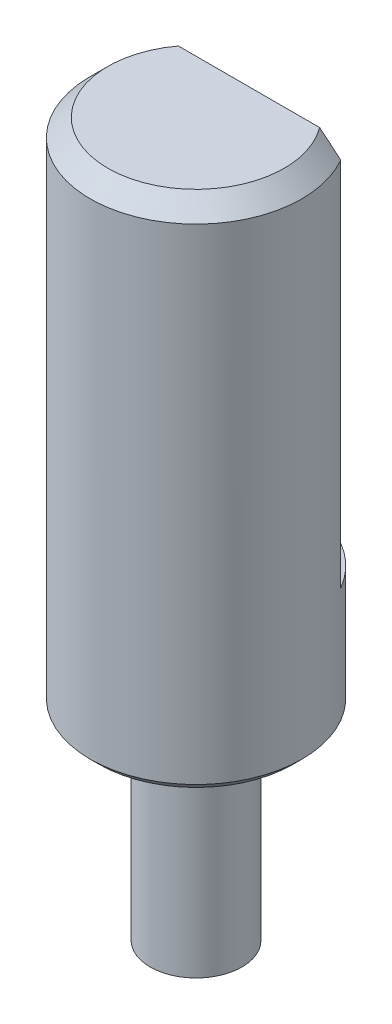
ISO-10303-21;
HEADER;
FILE_DESCRIPTION(('STEP AP214'),'2;1');
FILE_NAME('part.step','',(''),(''),'','','');
FILE_SCHEMA(('AUTOMOTIVE_DESIGN { 1 0 10303 214 1 1 1 1 }'));
ENDSEC;
DATA;
#1=APPLICATION_CONTEXT('core data for automotive mechanical design processes');
#2=APPLICATION_PROTOCOL_DEFINITION('international standard','automotive_design',2000,#1);
#3=PRODUCT_CONTEXT('',#1,'mechanical');
#4=PRODUCT('Part','Part','',(#3));
#5=PRODUCT_RELATED_PRODUCT_CATEGORY('part','',(#4));
#6=PRODUCT_DEFINITION_FORMATION('','',#4);
#7=PRODUCT_DEFINITION_CONTEXT('part definition',#1,'design');
#8=PRODUCT_DEFINITION('design','',#6,#7);
#9=PRODUCT_DEFINITION_SHAPE('','',#8);
#10=(LENGTH_UNIT() NAMED_UNIT(*) SI_UNIT(.MILLI.,.METRE.));
#11=(NAMED_UNIT(*) PLANE_ANGLE_UNIT() SI_UNIT($,.RADIAN.));
#12=(NAMED_UNIT(*) SI_UNIT($,.STERADIAN.) SOLID_ANGLE_UNIT());
#13=UNCERTAINTY_MEASURE_WITH_UNIT(LENGTH_MEASURE(1.E-05),#10,'distance_accuracy_value','');
#14=(GEOMETRIC_REPRESENTATION_CONTEXT(3) GLOBAL_UNCERTAINTY_ASSIGNED_CONTEXT((#13)) GLOBAL_UNIT_ASSIGNED_CONTEXT((#10,
#11,#12)) REPRESENTATION_CONTEXT('',''));
#15=CARTESIAN_POINT('',(0.,0.,0.));
#16=DIRECTION('',(0.,0.,1.));
#17=DIRECTION('',(1.,0.,0.));
#18=AXIS2_PLACEMENT_3D('',#15,#16,#17);
#19=CARTESIAN_POINT('',(0.,5.7,0.));
#20=DIRECTION('',(0.,-1.,0.));
#21=DIRECTION('',(0.,0.,-1.));
#22=AXIS2_PLACEMENT_3D('',#19,#20,#21);
#23=CYLINDRICAL_SURFACE('',#22,1.3);
#24=CARTESIAN_POINT('',(0.,5.7,0.));
#25=DIRECTION('',(0.,1.,0.));
#26=DIRECTION('',(0.,0.,1.));
#27=AXIS2_PLACEMENT_3D('',#24,#25,#26);
#28=CIRCLE('',#27,1.3);
#29=CARTESIAN_POINT('',(0.,5.7,1.3));
#30=VERTEX_POINT('',#29);
#31=EDGE_CURVE('E89',#30,#30,#28,.T.);
#32=ORIENTED_EDGE('',*,*,#31,.F.);
#33=EDGE_LOOP('',(#32));
#34=FACE_BOUND('',#33,.T.);
#35=CARTESIAN_POINT('',(0.,0.,0.));
#36=DIRECTION('',(0.,1.,0.));
#37=DIRECTION('',(0.,0.,1.));
#38=AXIS2_PLACEMENT_3D('',#35,#36,#37);
#39=CIRCLE('',#38,1.3);
#40=CARTESIAN_POINT('',(0.,0.,1.3));
#41=VERTEX_POINT('',#40);
#42=EDGE_CURVE('E85',#41,#41,#39,.T.);
#43=ORIENTED_EDGE('',*,*,#42,.T.);
#44=EDGE_LOOP('',(#43));
#45=FACE_BOUND('',#44,.T.);
#46=ADVANCED_FACE('F37',(#34,#45),#23,.T.);
#47=CARTESIAN_POINT('',(0.,0.,0.));
#48=DIRECTION('',(0.,1.,0.));
#49=DIRECTION('',(0.,0.,1.));
#50=AXIS2_PLACEMENT_3D('',#47,#48,#49);
#51=PLANE('',#50);
#52=ORIENTED_EDGE('',*,*,#42,.F.);
#53=EDGE_LOOP('',(#52));
#54=FACE_BOUND('',#53,.T.);
#55=ADVANCED_FACE('F129',(#54),#51,.F.);
#56=CARTESIAN_POINT('',(0.,20.2,0.));
#57=DIRECTION('',(0.,-1.,0.));
#58=DIRECTION('',(0.,0.,-1.));
#59=AXIS2_PLACEMENT_3D('',#56,#57,#58);
#60=CYLINDRICAL_SURFACE('',#59,3.);
#61=DIRECTION('',(0.,1.,0.));
#62=VECTOR('',#61,1.);
#63=CARTESIAN_POINT('',(2.59807621135332,9.2,-1.5));
#64=LINE('',#63,#62);
#65=CARTESIAN_POINT('',(2.59807621135332,9.2,-1.5));
#66=VERTEX_POINT('',#65);
#67=CARTESIAN_POINT('',(2.59807621135332,19.7,-1.5));
#68=VERTEX_POINT('',#67);
#69=EDGE_CURVE('E80',#66,#68,#64,.T.);
#70=ORIENTED_EDGE('',*,*,#69,.T.);
#71=CARTESIAN_POINT('',(0.,19.7,0.));
#72=DIRECTION('',(0.,1.,0.));
#73=DIRECTION('',(0.,0.,1.));
#74=AXIS2_PLACEMENT_3D('',#71,#72,#73);
#75=CIRCLE('',#74,3.);
#76=CARTESIAN_POINT('',(-2.59807621135332,19.7,-1.5));
#77=VERTEX_POINT('',#76);
#78=EDGE_CURVE('E11',#68,#77,#75,.F.);
#79=ORIENTED_EDGE('',*,*,#78,.T.);
#80=DIRECTION('',(0.,1.,0.));
#81=VECTOR('',#80,1.);
#82=CARTESIAN_POINT('',(-2.59807621135332,9.2,-1.5));
#83=LINE('',#82,#81);
#84=CARTESIAN_POINT('',(-2.59807621135332,9.2,-1.5));
#85=VERTEX_POINT('',#84);
#86=EDGE_CURVE('E78',#85,#77,#83,.T.);
#87=ORIENTED_EDGE('',*,*,#86,.F.);
#88=CARTESIAN_POINT('',(0.,9.2,0.));
#89=DIRECTION('',(0.,1.,0.));
#90=DIRECTION('',(0.,0.,1.));
#91=AXIS2_PLACEMENT_3D('',#88,#89,#90);
#92=CIRCLE('',#91,3.);
#93=EDGE_CURVE('E71',#66,#85,#92,.T.);
#94=ORIENTED_EDGE('',*,*,#93,.F.);
#95=EDGE_LOOP('',(#70,#79,#87,#94));
#96=FACE_BOUND('',#95,.T.);
#97=CARTESIAN_POINT('',(0.,5.95000000000001,0.));
#98=DIRECTION('',(0.,1.,0.));
#99=DIRECTION('',(0.,0.,1.));
#100=AXIS2_PLACEMENT_3D('',#97,#98,#99);
#101=CIRCLE('',#100,3.);
#102=CARTESIAN_POINT('',(0.,5.95000000000001,3.));
#103=VERTEX_POINT('',#102);
#104=EDGE_CURVE('E92',#103,#103,#101,.T.);
#105=ORIENTED_EDGE('',*,*,#104,.T.);
#106=EDGE_LOOP('',(#105));
#107=FACE_BOUND('',#106,.T.);
#108=ADVANCED_FACE('F82',(#96,#107),#60,.T.);
#109=CARTESIAN_POINT('',(0.,20.2,0.));
#110=DIRECTION('',(0.,1.,0.));
#111=DIRECTION('',(0.,0.,1.));
#112=AXIS2_PLACEMENT_3D('',#109,#110,#111);
#113=PLANE('',#112);
#114=DIRECTION('',(1.,0.,0.));
#115=VECTOR('',#114,1.);
#116=CARTESIAN_POINT('',(-2.59807621135332,20.2,-1.5));
#117=LINE('',#116,#115);
#118=CARTESIAN_POINT('',(-2.00000000000001,20.2,-1.5));
#119=VERTEX_POINT('',#118);
#120=CARTESIAN_POINT('',(2.00000000000001,20.2,-1.5));
#121=VERTEX_POINT('',#120);
#122=EDGE_CURVE('E75',#119,#121,#117,.T.);
#123=ORIENTED_EDGE('',*,*,#122,.F.);
#124=CARTESIAN_POINT('',(0.,20.2,0.));
#125=DIRECTION('',(0.,1.,0.));
#126=DIRECTION('',(0.,0.,1.));
#127=AXIS2_PLACEMENT_3D('',#124,#125,#126);
#128=CIRCLE('',#127,2.50000000000001);
#129=EDGE_CURVE('E100',#119,#121,#128,.T.);
#130=ORIENTED_EDGE('',*,*,#129,.T.);
#131=EDGE_LOOP('',(#123,#130));
#132=FACE_BOUND('',#131,.T.);
#133=ADVANCED_FACE('F118',(#132),#113,.T.);
#134=CARTESIAN_POINT('',(0.,5.7,0.));
#135=DIRECTION('',(0.,1.,0.));
#136=DIRECTION('',(0.,0.,1.));
#137=AXIS2_PLACEMENT_3D('',#134,#135,#136);
#138=PLANE('',#137);
#139=CARTESIAN_POINT('',(0.,5.7,0.));
#140=DIRECTION('',(0.,1.,0.));
#141=DIRECTION('',(0.,0.,1.));
#142=AXIS2_PLACEMENT_3D('',#139,#140,#141);
#143=CIRCLE('',#142,2.74999999999999);
#144=CARTESIAN_POINT('',(0.,5.7,2.74999999999999));
#145=VERTEX_POINT('',#144);
#146=EDGE_CURVE('E97',#145,#145,#143,.F.);
#147=ORIENTED_EDGE('',*,*,#146,.T.);
#148=EDGE_LOOP('',(#147));
#149=FACE_BOUND('',#148,.T.);
#150=ORIENTED_EDGE('',*,*,#31,.T.);
#151=EDGE_LOOP('',(#150));
#152=FACE_BOUND('',#151,.T.);
#153=ADVANCED_FACE('F122',(#149,#152),#138,.F.);
#154=CARTESIAN_POINT('',(0.,5.95000000000001,0.));
#155=DIRECTION('',(0.,1.,0.));
#156=DIRECTION('',(0.,0.,1.));
#157=AXIS2_PLACEMENT_3D('',#154,#155,#156);
#158=CONICAL_SURFACE('',#157,3.,0.785398163397448);
#159=ORIENTED_EDGE('',*,*,#146,.F.);
#160=EDGE_LOOP('',(#159));
#161=FACE_BOUND('',#160,.T.);
#162=ORIENTED_EDGE('',*,*,#104,.F.);
#163=EDGE_LOOP('',(#162));
#164=FACE_BOUND('',#163,.T.);
#165=ADVANCED_FACE('F117',(#161,#164),#158,.T.);
#166=CARTESIAN_POINT('',(-2.59807621135332,9.2,-1.5));
#167=DIRECTION('',(0.,0.,1.));
#168=DIRECTION('',(1.,0.,0.));
#169=AXIS2_PLACEMENT_3D('',#166,#167,#168);
#170=PLANE('',#169);
#171=ORIENTED_EDGE('',*,*,#122,.T.);
#172=CARTESIAN_POINT('',(2.00000000000001,20.2,-1.5));
#173=CARTESIAN_POINT('',(2.05073096834371,20.1594091541126,-1.5));
#174=CARTESIAN_POINT('',(2.10119559346293,20.1184877796223,-1.5));
#175=CARTESIAN_POINT('',(2.20165596476533,20.0360826364181,-1.5));
#176=CARTESIAN_POINT('',(2.25165175427951,19.9945989205613,-1.5));
#177=CARTESIAN_POINT('',(2.35124649520412,19.9111611597559,-1.5));
#178=CARTESIAN_POINT('',(2.40084545624944,19.8692071262861,-1.5));
#179=CARTESIAN_POINT('',(2.49970382878964,19.7848914399475,-1.5));
#180=CARTESIAN_POINT('',(2.54896320821956,19.7425297494666,-1.5));
#181=CARTESIAN_POINT('',(2.59807621135341,19.7000000000001,-1.5));
#182=B_SPLINE_CURVE_WITH_KNOTS('',3,(#172,#173,#174,#175,#176,#177,#178,#179,#180,#181),
.UNSPECIFIED.,.F.,.F.,(4,2,2,2,4),(0.,0.194909899355778,0.38980160348904,0.584688561258781,
0.779593675856239),.UNSPECIFIED.);
#183=EDGE_CURVE('E46',#121,#68,#182,.T.);
#184=ORIENTED_EDGE('',*,*,#183,.T.);
#185=ORIENTED_EDGE('',*,*,#69,.F.);
#186=DIRECTION('',(1.,0.,0.));
#187=VECTOR('',#186,1.);
#188=CARTESIAN_POINT('',(-2.59807621135332,9.2,-1.5));
#189=LINE('',#188,#187);
#190=EDGE_CURVE('E74',#85,#66,#189,.T.);
#191=ORIENTED_EDGE('',*,*,#190,.F.);
#192=ORIENTED_EDGE('',*,*,#86,.T.);
#193=CARTESIAN_POINT('',(-2.59807621135332,19.7,-1.5));
#194=CARTESIAN_POINT('',(-2.54896320821952,19.7425297494665,-1.5));
#195=CARTESIAN_POINT('',(-2.49970382878963,19.7848914399475,-1.5));
#196=CARTESIAN_POINT('',(-2.40084545624945,19.8692071262861,-1.5));
#197=CARTESIAN_POINT('',(-2.35124649520413,19.9111611597559,-1.5));
#198=CARTESIAN_POINT('',(-2.2516517542795,19.9945989205613,-1.5));
#199=CARTESIAN_POINT('',(-2.20165596476531,20.036082636418,-1.5));
#200=CARTESIAN_POINT('',(-2.10119559346297,20.1184877796224,-1.5));
#201=CARTESIAN_POINT('',(-2.05073096834384,20.1594091541128,-1.5));
#202=CARTESIAN_POINT('',(-2.00000000000032,20.2000000000004,-1.5));
#203=B_SPLINE_CURVE_WITH_KNOTS('',3,(#193,#194,#195,#196,#197,#198,#199,#200,#201,#202),
.UNSPECIFIED.,.F.,.F.,(4,2,2,2,4),(0.,0.194905114597462,0.389792072367198,0.584683776500454,
0.779593675856229),.UNSPECIFIED.);
#204=EDGE_CURVE('E103',#77,#119,#203,.T.);
#205=ORIENTED_EDGE('',*,*,#204,.T.);
#206=EDGE_LOOP('',(#171,#184,#185,#191,#192,#205));
#207=FACE_BOUND('',#206,.T.);
#208=ADVANCED_FACE('F77',(#207),#170,.F.);
#209=CARTESIAN_POINT('',(0.,9.2,0.));
#210=DIRECTION('',(0.,1.,0.));
#211=DIRECTION('',(0.,0.,1.));
#212=AXIS2_PLACEMENT_3D('',#209,#210,#211);
#213=PLANE('',#212);
#214=ORIENTED_EDGE('',*,*,#93,.T.);
#215=ORIENTED_EDGE('',*,*,#190,.T.);
#216=EDGE_LOOP('',(#214,#215));
#217=FACE_BOUND('',#216,.T.);
#218=ADVANCED_FACE('F73',(#217),#213,.T.);
#219=CARTESIAN_POINT('',(0.,20.2,0.));
#220=DIRECTION('',(0.,-1.,0.));
#221=DIRECTION('',(0.,0.,-1.));
#222=AXIS2_PLACEMENT_3D('',#219,#220,#221);
#223=CONICAL_SURFACE('',#222,2.50000000000001,0.785398163397447);
#224=ORIENTED_EDGE('',*,*,#204,.F.);
#225=ORIENTED_EDGE('',*,*,#78,.F.);
#226=ORIENTED_EDGE('',*,*,#183,.F.);
#227=ORIENTED_EDGE('',*,*,#129,.F.);
#228=EDGE_LOOP('',(#224,#225,#226,#227));
#229=FACE_BOUND('',#228,.T.);
#230=ADVANCED_FACE('F39',(#229),#223,.T.);
#231=CLOSED_SHELL('',(#46,#55,#108,#133,#153,#165,#208,#218,#230));
#232=MANIFOLD_SOLID_BREP('B2',#231);
#233=ADVANCED_BREP_SHAPE_REPRESENTATION('',(#18,#232),#14);
#234=SHAPE_DEFINITION_REPRESENTATION(#9,#233);
ENDSEC;
END-ISO-10303-21;
